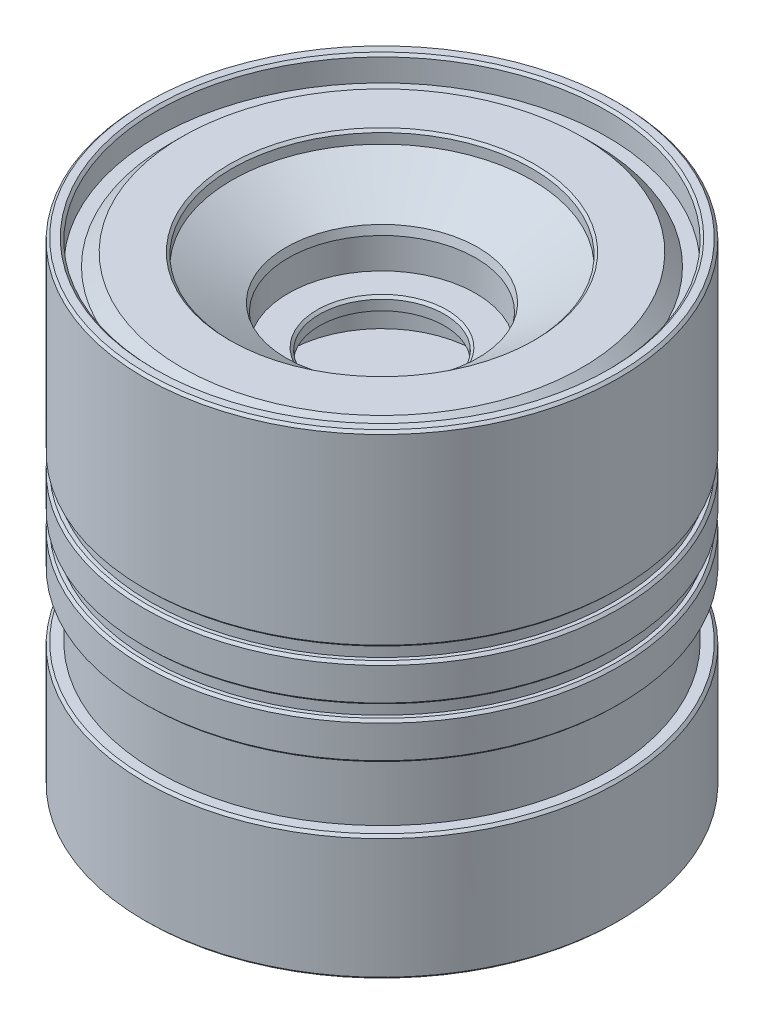
ISO-10303-21;
HEADER;
FILE_DESCRIPTION(('STEP AP214'),'2;1');
FILE_NAME('part.step','',(''),(''),'','','');
FILE_SCHEMA(('AUTOMOTIVE_DESIGN { 1 0 10303 214 1 1 1 1 }'));
ENDSEC;
DATA;
#1=APPLICATION_CONTEXT('core data for automotive mechanical design processes');
#2=APPLICATION_PROTOCOL_DEFINITION('international standard','automotive_design',2000,#1);
#3=PRODUCT_CONTEXT('',#1,'mechanical');
#4=PRODUCT('Part','Part','',(#3));
#5=PRODUCT_RELATED_PRODUCT_CATEGORY('part','',(#4));
#6=PRODUCT_DEFINITION_FORMATION('','',#4);
#7=PRODUCT_DEFINITION_CONTEXT('part definition',#1,'design');
#8=PRODUCT_DEFINITION('design','',#6,#7);
#9=PRODUCT_DEFINITION_SHAPE('','',#8);
#10=(LENGTH_UNIT() NAMED_UNIT(*) SI_UNIT(.MILLI.,.METRE.));
#11=(NAMED_UNIT(*) PLANE_ANGLE_UNIT() SI_UNIT($,.RADIAN.));
#12=(NAMED_UNIT(*) SI_UNIT($,.STERADIAN.) SOLID_ANGLE_UNIT());
#13=UNCERTAINTY_MEASURE_WITH_UNIT(LENGTH_MEASURE(1.E-05),#10,'distance_accuracy_value','');
#14=(GEOMETRIC_REPRESENTATION_CONTEXT(3) GLOBAL_UNCERTAINTY_ASSIGNED_CONTEXT((#13)) GLOBAL_UNIT_ASSIGNED_CONTEXT((#10,
#11,#12)) REPRESENTATION_CONTEXT('',''));
#15=CARTESIAN_POINT('',(0.,0.,0.));
#16=DIRECTION('',(0.,0.,1.));
#17=DIRECTION('',(1.,0.,0.));
#18=AXIS2_PLACEMENT_3D('',#15,#16,#17);
#19=CARTESIAN_POINT('',(0.,0.,0.));
#20=DIRECTION('',(0.,-1.,0.));
#21=DIRECTION('',(0.,0.,-1.));
#22=AXIS2_PLACEMENT_3D('',#19,#20,#21);
#23=PLANE('',#22);
#24=CARTESIAN_POINT('',(0.,0.,0.));
#25=DIRECTION('',(0.,-1.,0.));
#26=DIRECTION('',(0.,0.,-1.));
#27=AXIS2_PLACEMENT_3D('',#24,#25,#26);
#28=CIRCLE('',#27,18.8);
#29=CARTESIAN_POINT('',(0.,0.,-18.8));
#30=VERTEX_POINT('',#29);
#31=EDGE_CURVE('E92',#30,#30,#28,.T.);
#32=ORIENTED_EDGE('',*,*,#31,.T.);
#33=EDGE_LOOP('',(#32));
#34=FACE_BOUND('',#33,.T.);
#35=ADVANCED_FACE('F33',(#34),#23,.T.);
#36=CARTESIAN_POINT('',(0.,26.4019237886467,0.));
#37=DIRECTION('',(0.,1.,0.));
#38=DIRECTION('',(0.,0.,1.));
#39=AXIS2_PLACEMENT_3D('',#36,#37,#38);
#40=CYLINDRICAL_SURFACE('',#39,19.);
#41=CARTESIAN_POINT('',(0.,9.80000000000001,0.));
#42=DIRECTION('',(0.,1.,0.));
#43=DIRECTION('',(0.,0.,1.));
#44=AXIS2_PLACEMENT_3D('',#41,#42,#43);
#45=CIRCLE('',#44,19.);
#46=CARTESIAN_POINT('',(0.,9.8,19.));
#47=VERTEX_POINT('',#46);
#48=EDGE_CURVE('E95',#47,#47,#45,.F.);
#49=ORIENTED_EDGE('',*,*,#48,.T.);
#50=EDGE_LOOP('',(#49));
#51=FACE_BOUND('',#50,.T.);
#52=CARTESIAN_POINT('',(0.,0.199999999999975,0.));
#53=DIRECTION('',(0.,-1.,0.));
#54=DIRECTION('',(0.,0.,-1.));
#55=AXIS2_PLACEMENT_3D('',#52,#53,#54);
#56=CIRCLE('',#55,19.);
#57=CARTESIAN_POINT('',(0.,0.199999999999977,-19.));
#58=VERTEX_POINT('',#57);
#59=EDGE_CURVE('E98',#58,#58,#56,.F.);
#60=ORIENTED_EDGE('',*,*,#59,.T.);
#61=EDGE_LOOP('',(#60));
#62=FACE_BOUND('',#61,.T.);
#63=ADVANCED_FACE('F173',(#51,#62),#40,.T.);
#64=CARTESIAN_POINT('',(0.,10.,19.));
#65=DIRECTION('',(0.,1.,0.));
#66=DIRECTION('',(0.,0.,1.));
#67=AXIS2_PLACEMENT_3D('',#64,#65,#66);
#68=PLANE('',#67);
#69=CARTESIAN_POINT('',(0.,10.,0.));
#70=DIRECTION('',(0.,1.,0.));
#71=DIRECTION('',(0.,0.,1.));
#72=AXIS2_PLACEMENT_3D('',#69,#70,#71);
#73=CIRCLE('',#72,18.8);
#74=CARTESIAN_POINT('',(0.,10.,18.8));
#75=VERTEX_POINT('',#74);
#76=EDGE_CURVE('E101',#75,#75,#73,.T.);
#77=ORIENTED_EDGE('',*,*,#76,.T.);
#78=EDGE_LOOP('',(#77));
#79=FACE_BOUND('',#78,.T.);
#80=CARTESIAN_POINT('',(0.,10.,0.));
#81=DIRECTION('',(0.,1.,0.));
#82=DIRECTION('',(0.,0.,1.));
#83=AXIS2_PLACEMENT_3D('',#80,#81,#82);
#84=CIRCLE('',#83,18.);
#85=CARTESIAN_POINT('',(0.,10.,18.));
#86=VERTEX_POINT('',#85);
#87=EDGE_CURVE('E113',#86,#86,#84,.T.);
#88=ORIENTED_EDGE('',*,*,#87,.F.);
#89=EDGE_LOOP('',(#88));
#90=FACE_BOUND('',#89,.T.);
#91=ADVANCED_FACE('F179',(#79,#90),#68,.T.);
#92=CARTESIAN_POINT('',(0.,26.4019237886467,0.));
#93=DIRECTION('',(0.,1.,0.));
#94=DIRECTION('',(0.,0.,1.));
#95=AXIS2_PLACEMENT_3D('',#92,#93,#94);
#96=CYLINDRICAL_SURFACE('',#95,18.);
#97=ORIENTED_EDGE('',*,*,#87,.T.);
#98=EDGE_LOOP('',(#97));
#99=FACE_BOUND('',#98,.T.);
#100=CARTESIAN_POINT('',(0.,15.,0.));
#101=DIRECTION('',(0.,1.,0.));
#102=DIRECTION('',(0.,0.,1.));
#103=AXIS2_PLACEMENT_3D('',#100,#101,#102);
#104=CIRCLE('',#103,18.);
#105=CARTESIAN_POINT('',(0.,15.,18.));
#106=VERTEX_POINT('',#105);
#107=EDGE_CURVE('E116',#106,#106,#104,.T.);
#108=ORIENTED_EDGE('',*,*,#107,.F.);
#109=EDGE_LOOP('',(#108));
#110=FACE_BOUND('',#109,.T.);
#111=ADVANCED_FACE('F314',(#99,#110),#96,.T.);
#112=CARTESIAN_POINT('',(0.,15.,18.));
#113=DIRECTION('',(0.,-1.,0.));
#114=DIRECTION('',(0.,0.,-1.));
#115=AXIS2_PLACEMENT_3D('',#112,#113,#114);
#116=PLANE('',#115);
#117=CARTESIAN_POINT('',(0.,15.,0.));
#118=DIRECTION('',(0.,-1.,0.));
#119=DIRECTION('',(0.,0.,-1.));
#120=AXIS2_PLACEMENT_3D('',#117,#118,#119);
#121=CIRCLE('',#120,18.8);
#122=CARTESIAN_POINT('',(0.,15.,-18.8));
#123=VERTEX_POINT('',#122);
#124=EDGE_CURVE('E80',#123,#123,#121,.T.);
#125=ORIENTED_EDGE('',*,*,#124,.T.);
#126=EDGE_LOOP('',(#125));
#127=FACE_BOUND('',#126,.T.);
#128=ORIENTED_EDGE('',*,*,#107,.T.);
#129=EDGE_LOOP('',(#128));
#130=FACE_BOUND('',#129,.T.);
#131=ADVANCED_FACE('F310',(#127,#130),#116,.T.);
#132=CARTESIAN_POINT('',(0.,26.4019237886467,0.));
#133=DIRECTION('',(0.,1.,0.));
#134=DIRECTION('',(0.,0.,1.));
#135=AXIS2_PLACEMENT_3D('',#132,#133,#134);
#136=CYLINDRICAL_SURFACE('',#135,19.);
#137=CARTESIAN_POINT('',(0.,17.8,0.));
#138=DIRECTION('',(0.,1.,0.));
#139=DIRECTION('',(0.,0.,1.));
#140=AXIS2_PLACEMENT_3D('',#137,#138,#139);
#141=CIRCLE('',#140,19.);
#142=CARTESIAN_POINT('',(0.,17.8,19.));
#143=VERTEX_POINT('',#142);
#144=EDGE_CURVE('E83',#143,#143,#141,.F.);
#145=ORIENTED_EDGE('',*,*,#144,.T.);
#146=EDGE_LOOP('',(#145));
#147=FACE_BOUND('',#146,.T.);
#148=CARTESIAN_POINT('',(0.,15.2,0.));
#149=DIRECTION('',(0.,-1.,0.));
#150=DIRECTION('',(0.,0.,-1.));
#151=AXIS2_PLACEMENT_3D('',#148,#149,#150);
#152=CIRCLE('',#151,19.);
#153=CARTESIAN_POINT('',(0.,15.2,-19.));
#154=VERTEX_POINT('',#153);
#155=EDGE_CURVE('E86',#154,#154,#152,.F.);
#156=ORIENTED_EDGE('',*,*,#155,.T.);
#157=EDGE_LOOP('',(#156));
#158=FACE_BOUND('',#157,.T.);
#159=ADVANCED_FACE('F306',(#147,#158),#136,.T.);
#160=CARTESIAN_POINT('',(0.,18.,19.));
#161=DIRECTION('',(0.,1.,0.));
#162=DIRECTION('',(0.,0.,1.));
#163=AXIS2_PLACEMENT_3D('',#160,#161,#162);
#164=PLANE('',#163);
#165=CARTESIAN_POINT('',(0.,18.,0.));
#166=DIRECTION('',(0.,1.,0.));
#167=DIRECTION('',(0.,0.,1.));
#168=AXIS2_PLACEMENT_3D('',#165,#166,#167);
#169=CIRCLE('',#168,18.8);
#170=CARTESIAN_POINT('',(0.,18.,18.8));
#171=VERTEX_POINT('',#170);
#172=EDGE_CURVE('E89',#171,#171,#169,.T.);
#173=ORIENTED_EDGE('',*,*,#172,.T.);
#174=EDGE_LOOP('',(#173));
#175=FACE_BOUND('',#174,.T.);
#176=CARTESIAN_POINT('',(0.,18.,0.));
#177=DIRECTION('',(0.,1.,0.));
#178=DIRECTION('',(0.,0.,1.));
#179=AXIS2_PLACEMENT_3D('',#176,#177,#178);
#180=CIRCLE('',#179,18.5);
#181=CARTESIAN_POINT('',(0.,18.,18.5));
#182=VERTEX_POINT('',#181);
#183=EDGE_CURVE('E119',#182,#182,#180,.T.);
#184=ORIENTED_EDGE('',*,*,#183,.F.);
#185=EDGE_LOOP('',(#184));
#186=FACE_BOUND('',#185,.T.);
#187=ADVANCED_FACE('F302',(#175,#186),#164,.T.);
#188=CARTESIAN_POINT('',(0.,26.4019237886467,0.));
#189=DIRECTION('',(0.,1.,0.));
#190=DIRECTION('',(0.,0.,1.));
#191=AXIS2_PLACEMENT_3D('',#188,#189,#190);
#192=CYLINDRICAL_SURFACE('',#191,18.5);
#193=ORIENTED_EDGE('',*,*,#183,.T.);
#194=EDGE_LOOP('',(#193));
#195=FACE_BOUND('',#194,.T.);
#196=CARTESIAN_POINT('',(0.,19.,0.));
#197=DIRECTION('',(0.,1.,0.));
#198=DIRECTION('',(0.,0.,1.));
#199=AXIS2_PLACEMENT_3D('',#196,#197,#198);
#200=CIRCLE('',#199,18.5);
#201=CARTESIAN_POINT('',(0.,19.,18.5));
#202=VERTEX_POINT('',#201);
#203=EDGE_CURVE('E122',#202,#202,#200,.T.);
#204=ORIENTED_EDGE('',*,*,#203,.F.);
#205=EDGE_LOOP('',(#204));
#206=FACE_BOUND('',#205,.T.);
#207=ADVANCED_FACE('F298',(#195,#206),#192,.T.);
#208=CARTESIAN_POINT('',(0.,19.,18.5));
#209=DIRECTION('',(0.,-1.,0.));
#210=DIRECTION('',(0.,0.,-1.));
#211=AXIS2_PLACEMENT_3D('',#208,#209,#210);
#212=PLANE('',#211);
#213=CARTESIAN_POINT('',(0.,19.,0.));
#214=DIRECTION('',(0.,-1.,0.));
#215=DIRECTION('',(0.,0.,-1.));
#216=AXIS2_PLACEMENT_3D('',#213,#214,#215);
#217=CIRCLE('',#216,18.8);
#218=CARTESIAN_POINT('',(0.,19.,-18.8));
#219=VERTEX_POINT('',#218);
#220=EDGE_CURVE('E68',#219,#219,#217,.T.);
#221=ORIENTED_EDGE('',*,*,#220,.T.);
#222=EDGE_LOOP('',(#221));
#223=FACE_BOUND('',#222,.T.);
#224=ORIENTED_EDGE('',*,*,#203,.T.);
#225=EDGE_LOOP('',(#224));
#226=FACE_BOUND('',#225,.T.);
#227=ADVANCED_FACE('F294',(#223,#226),#212,.T.);
#228=CARTESIAN_POINT('',(0.,26.4019237886467,0.));
#229=DIRECTION('',(0.,1.,0.));
#230=DIRECTION('',(0.,0.,1.));
#231=AXIS2_PLACEMENT_3D('',#228,#229,#230);
#232=CYLINDRICAL_SURFACE('',#231,19.);
#233=CARTESIAN_POINT('',(0.,21.8,0.));
#234=DIRECTION('',(0.,1.,0.));
#235=DIRECTION('',(0.,0.,1.));
#236=AXIS2_PLACEMENT_3D('',#233,#234,#235);
#237=CIRCLE('',#236,19.);
#238=CARTESIAN_POINT('',(0.,21.8,19.));
#239=VERTEX_POINT('',#238);
#240=EDGE_CURVE('E71',#239,#239,#237,.F.);
#241=ORIENTED_EDGE('',*,*,#240,.T.);
#242=EDGE_LOOP('',(#241));
#243=FACE_BOUND('',#242,.T.);
#244=CARTESIAN_POINT('',(0.,19.2,0.));
#245=DIRECTION('',(0.,-1.,0.));
#246=DIRECTION('',(0.,0.,-1.));
#247=AXIS2_PLACEMENT_3D('',#244,#245,#246);
#248=CIRCLE('',#247,19.);
#249=CARTESIAN_POINT('',(0.,19.2,-19.));
#250=VERTEX_POINT('',#249);
#251=EDGE_CURVE('E74',#250,#250,#248,.F.);
#252=ORIENTED_EDGE('',*,*,#251,.T.);
#253=EDGE_LOOP('',(#252));
#254=FACE_BOUND('',#253,.T.);
#255=ADVANCED_FACE('F290',(#243,#254),#232,.T.);
#256=CARTESIAN_POINT('',(0.,22.,19.));
#257=DIRECTION('',(0.,1.,0.));
#258=DIRECTION('',(0.,0.,1.));
#259=AXIS2_PLACEMENT_3D('',#256,#257,#258);
#260=PLANE('',#259);
#261=CARTESIAN_POINT('',(0.,22.,0.));
#262=DIRECTION('',(0.,1.,0.));
#263=DIRECTION('',(0.,0.,1.));
#264=AXIS2_PLACEMENT_3D('',#261,#262,#263);
#265=CIRCLE('',#264,18.8);
#266=CARTESIAN_POINT('',(0.,22.,18.8));
#267=VERTEX_POINT('',#266);
#268=EDGE_CURVE('E77',#267,#267,#265,.T.);
#269=ORIENTED_EDGE('',*,*,#268,.T.);
#270=EDGE_LOOP('',(#269));
#271=FACE_BOUND('',#270,.T.);
#272=CARTESIAN_POINT('',(0.,22.,0.));
#273=DIRECTION('',(0.,1.,0.));
#274=DIRECTION('',(0.,0.,1.));
#275=AXIS2_PLACEMENT_3D('',#272,#273,#274);
#276=CIRCLE('',#275,18.5);
#277=CARTESIAN_POINT('',(0.,22.,18.5));
#278=VERTEX_POINT('',#277);
#279=EDGE_CURVE('E125',#278,#278,#276,.T.);
#280=ORIENTED_EDGE('',*,*,#279,.F.);
#281=EDGE_LOOP('',(#280));
#282=FACE_BOUND('',#281,.T.);
#283=ADVANCED_FACE('F286',(#271,#282),#260,.T.);
#284=CARTESIAN_POINT('',(0.,26.4019237886467,0.));
#285=DIRECTION('',(0.,1.,0.));
#286=DIRECTION('',(0.,0.,1.));
#287=AXIS2_PLACEMENT_3D('',#284,#285,#286);
#288=CYLINDRICAL_SURFACE('',#287,18.5);
#289=ORIENTED_EDGE('',*,*,#279,.T.);
#290=EDGE_LOOP('',(#289));
#291=FACE_BOUND('',#290,.T.);
#292=CARTESIAN_POINT('',(0.,23.,0.));
#293=DIRECTION('',(0.,1.,0.));
#294=DIRECTION('',(0.,0.,1.));
#295=AXIS2_PLACEMENT_3D('',#292,#293,#294);
#296=CIRCLE('',#295,18.5);
#297=CARTESIAN_POINT('',(0.,23.,18.5));
#298=VERTEX_POINT('',#297);
#299=EDGE_CURVE('E128',#298,#298,#296,.T.);
#300=ORIENTED_EDGE('',*,*,#299,.F.);
#301=EDGE_LOOP('',(#300));
#302=FACE_BOUND('',#301,.T.);
#303=ADVANCED_FACE('F282',(#291,#302),#288,.T.);
#304=CARTESIAN_POINT('',(0.,23.,18.5));
#305=DIRECTION('',(0.,-1.,0.));
#306=DIRECTION('',(0.,0.,-1.));
#307=AXIS2_PLACEMENT_3D('',#304,#305,#306);
#308=PLANE('',#307);
#309=CARTESIAN_POINT('',(0.,23.,0.));
#310=DIRECTION('',(0.,-1.,0.));
#311=DIRECTION('',(0.,0.,-1.));
#312=AXIS2_PLACEMENT_3D('',#309,#310,#311);
#313=CIRCLE('',#312,18.8);
#314=CARTESIAN_POINT('',(0.,23.,18.8));
#315=VERTEX_POINT('',#314);
#316=EDGE_CURVE('E59',#315,#315,#313,.T.);
#317=ORIENTED_EDGE('',*,*,#316,.T.);
#318=EDGE_LOOP('',(#317));
#319=FACE_BOUND('',#318,.T.);
#320=ORIENTED_EDGE('',*,*,#299,.T.);
#321=EDGE_LOOP('',(#320));
#322=FACE_BOUND('',#321,.T.);
#323=ADVANCED_FACE('F278',(#319,#322),#308,.T.);
#324=CARTESIAN_POINT('',(0.,26.4019237886467,0.));
#325=DIRECTION('',(0.,1.,0.));
#326=DIRECTION('',(0.,0.,1.));
#327=AXIS2_PLACEMENT_3D('',#324,#325,#326);
#328=CYLINDRICAL_SURFACE('',#327,19.);
#329=CARTESIAN_POINT('',(0.,37.8,0.));
#330=DIRECTION('',(0.,1.,0.));
#331=DIRECTION('',(0.,0.,1.));
#332=AXIS2_PLACEMENT_3D('',#329,#330,#331);
#333=CIRCLE('',#332,19.);
#334=CARTESIAN_POINT('',(0.,37.8,19.));
#335=VERTEX_POINT('',#334);
#336=EDGE_CURVE('E62',#335,#335,#333,.F.);
#337=ORIENTED_EDGE('',*,*,#336,.T.);
#338=EDGE_LOOP('',(#337));
#339=FACE_BOUND('',#338,.T.);
#340=CARTESIAN_POINT('',(0.,23.2,0.));
#341=DIRECTION('',(0.,-1.,0.));
#342=DIRECTION('',(0.,0.,-1.));
#343=AXIS2_PLACEMENT_3D('',#340,#341,#342);
#344=CIRCLE('',#343,19.);
#345=CARTESIAN_POINT('',(0.,23.2,19.));
#346=VERTEX_POINT('',#345);
#347=EDGE_CURVE('E65',#346,#346,#344,.F.);
#348=ORIENTED_EDGE('',*,*,#347,.T.);
#349=EDGE_LOOP('',(#348));
#350=FACE_BOUND('',#349,.T.);
#351=ADVANCED_FACE('F274',(#339,#350),#328,.T.);
#352=CARTESIAN_POINT('',(0.,38.,19.));
#353=DIRECTION('',(0.,1.,0.));
#354=DIRECTION('',(0.,0.,1.));
#355=AXIS2_PLACEMENT_3D('',#352,#353,#354);
#356=PLANE('',#355);
#357=CARTESIAN_POINT('',(0.,38.,0.));
#358=DIRECTION('',(0.,1.,0.));
#359=DIRECTION('',(0.,0.,1.));
#360=AXIS2_PLACEMENT_3D('',#357,#358,#359);
#361=CIRCLE('',#360,18.2);
#362=CARTESIAN_POINT('',(0.,38.,18.2));
#363=VERTEX_POINT('',#362);
#364=EDGE_CURVE('E104',#363,#363,#361,.F.);
#365=ORIENTED_EDGE('',*,*,#364,.T.);
#366=EDGE_LOOP('',(#365));
#367=FACE_BOUND('',#366,.T.);
#368=CARTESIAN_POINT('',(0.,38.,0.));
#369=DIRECTION('',(0.,1.,0.));
#370=DIRECTION('',(0.,0.,1.));
#371=AXIS2_PLACEMENT_3D('',#368,#369,#370);
#372=CIRCLE('',#371,18.8);
#373=CARTESIAN_POINT('',(0.,38.,18.8));
#374=VERTEX_POINT('',#373);
#375=EDGE_CURVE('E107',#374,#374,#372,.T.);
#376=ORIENTED_EDGE('',*,*,#375,.T.);
#377=EDGE_LOOP('',(#376));
#378=FACE_BOUND('',#377,.T.);
#379=ADVANCED_FACE('F270',(#367,#378),#356,.T.);
#380=CARTESIAN_POINT('',(0.,26.4019237886467,0.));
#381=DIRECTION('',(0.,1.,0.));
#382=DIRECTION('',(0.,0.,1.));
#383=AXIS2_PLACEMENT_3D('',#380,#381,#382);
#384=CYLINDRICAL_SURFACE('',#383,18.);
#385=CARTESIAN_POINT('',(0.,37.8,0.));
#386=DIRECTION('',(0.,1.,0.));
#387=DIRECTION('',(0.,0.,1.));
#388=AXIS2_PLACEMENT_3D('',#385,#386,#387);
#389=CIRCLE('',#388,18.);
#390=CARTESIAN_POINT('',(0.,37.8,18.));
#391=VERTEX_POINT('',#390);
#392=EDGE_CURVE('E110',#391,#391,#389,.T.);
#393=ORIENTED_EDGE('',*,*,#392,.T.);
#394=EDGE_LOOP('',(#393));
#395=FACE_BOUND('',#394,.T.);
#396=CARTESIAN_POINT('',(0.,36.,0.));
#397=DIRECTION('',(0.,1.,0.));
#398=DIRECTION('',(0.,0.,1.));
#399=AXIS2_PLACEMENT_3D('',#396,#397,#398);
#400=CIRCLE('',#399,18.);
#401=CARTESIAN_POINT('',(0.,36.,18.));
#402=VERTEX_POINT('',#401);
#403=EDGE_CURVE('E131',#402,#402,#400,.T.);
#404=ORIENTED_EDGE('',*,*,#403,.F.);
#405=EDGE_LOOP('',(#404));
#406=FACE_BOUND('',#405,.T.);
#407=ADVANCED_FACE('F266',(#395,#406),#384,.F.);
#408=CARTESIAN_POINT('',(0.,36.,18.));
#409=DIRECTION('',(0.,1.,0.));
#410=DIRECTION('',(0.,0.,1.));
#411=AXIS2_PLACEMENT_3D('',#408,#409,#410);
#412=PLANE('',#411);
#413=ORIENTED_EDGE('',*,*,#403,.T.);
#414=EDGE_LOOP('',(#413));
#415=FACE_BOUND('',#414,.T.);
#416=CARTESIAN_POINT('',(0.,36.,0.));
#417=DIRECTION('',(0.,1.,0.));
#418=DIRECTION('',(0.,0.,1.));
#419=AXIS2_PLACEMENT_3D('',#416,#417,#418);
#420=CIRCLE('',#419,17.);
#421=CARTESIAN_POINT('',(0.,36.,17.));
#422=VERTEX_POINT('',#421);
#423=EDGE_CURVE('E134',#422,#422,#420,.T.);
#424=ORIENTED_EDGE('',*,*,#423,.F.);
#425=EDGE_LOOP('',(#424));
#426=FACE_BOUND('',#425,.T.);
#427=ADVANCED_FACE('F262',(#415,#426),#412,.T.);
#428=CARTESIAN_POINT('',(0.,37.,0.));
#429=DIRECTION('',(0.,-1.,0.));
#430=DIRECTION('',(0.,0.,-1.));
#431=AXIS2_PLACEMENT_3D('',#428,#429,#430);
#432=CONICAL_SURFACE('',#431,16.,0.785398163397442);
#433=ORIENTED_EDGE('',*,*,#423,.T.);
#434=EDGE_LOOP('',(#433));
#435=FACE_BOUND('',#434,.T.);
#436=CARTESIAN_POINT('',(0.,37.,0.));
#437=DIRECTION('',(0.,1.,0.));
#438=DIRECTION('',(0.,0.,1.));
#439=AXIS2_PLACEMENT_3D('',#436,#437,#438);
#440=CIRCLE('',#439,16.);
#441=CARTESIAN_POINT('',(0.,37.,16.));
#442=VERTEX_POINT('',#441);
#443=EDGE_CURVE('E137',#442,#442,#440,.T.);
#444=ORIENTED_EDGE('',*,*,#443,.F.);
#445=EDGE_LOOP('',(#444));
#446=FACE_BOUND('',#445,.T.);
#447=ADVANCED_FACE('F259',(#435,#446),#432,.T.);
#448=CARTESIAN_POINT('',(0.,37.,16.));
#449=DIRECTION('',(0.,1.,0.));
#450=DIRECTION('',(0.,0.,1.));
#451=AXIS2_PLACEMENT_3D('',#448,#449,#450);
#452=PLANE('',#451);
#453=CARTESIAN_POINT('',(0.,37.,0.));
#454=DIRECTION('',(0.,1.,0.));
#455=DIRECTION('',(0.,0.,1.));
#456=AXIS2_PLACEMENT_3D('',#453,#454,#455);
#457=CIRCLE('',#456,12.2);
#458=CARTESIAN_POINT('',(0.,37.,12.2));
#459=VERTEX_POINT('',#458);
#460=EDGE_CURVE('E10',#459,#459,#457,.F.);
#461=ORIENTED_EDGE('',*,*,#460,.T.);
#462=EDGE_LOOP('',(#461));
#463=FACE_BOUND('',#462,.T.);
#464=ORIENTED_EDGE('',*,*,#443,.T.);
#465=EDGE_LOOP('',(#464));
#466=FACE_BOUND('',#465,.T.);
#467=ADVANCED_FACE('F256',(#463,#466),#452,.T.);
#468=CARTESIAN_POINT('',(0.,26.4019237886467,0.));
#469=DIRECTION('',(0.,1.,0.));
#470=DIRECTION('',(0.,0.,1.));
#471=AXIS2_PLACEMENT_3D('',#468,#469,#470);
#472=CYLINDRICAL_SURFACE('',#471,12.);
#473=CARTESIAN_POINT('',(0.,36.8,0.));
#474=DIRECTION('',(0.,1.,0.));
#475=DIRECTION('',(0.,0.,1.));
#476=AXIS2_PLACEMENT_3D('',#473,#474,#475);
#477=CIRCLE('',#476,12.);
#478=CARTESIAN_POINT('',(0.,36.8,12.));
#479=VERTEX_POINT('',#478);
#480=EDGE_CURVE('E40',#479,#479,#477,.T.);
#481=ORIENTED_EDGE('',*,*,#480,.T.);
#482=EDGE_LOOP('',(#481));
#483=FACE_BOUND('',#482,.T.);
#484=CARTESIAN_POINT('',(0.,36.,0.));
#485=DIRECTION('',(0.,1.,0.));
#486=DIRECTION('',(0.,0.,1.));
#487=AXIS2_PLACEMENT_3D('',#484,#485,#486);
#488=CIRCLE('',#487,12.);
#489=CARTESIAN_POINT('',(0.,36.,12.));
#490=VERTEX_POINT('',#489);
#491=EDGE_CURVE('E140',#490,#490,#488,.T.);
#492=ORIENTED_EDGE('',*,*,#491,.F.);
#493=EDGE_LOOP('',(#492));
#494=FACE_BOUND('',#493,.T.);
#495=ADVANCED_FACE('F252',(#483,#494),#472,.F.);
#496=CARTESIAN_POINT('',(0.,33.4019237886467,0.));
#497=DIRECTION('',(0.,1.,0.));
#498=DIRECTION('',(0.,0.,1.));
#499=AXIS2_PLACEMENT_3D('',#496,#497,#498);
#500=CONICAL_SURFACE('',#499,7.5,1.0471975511966);
#501=CARTESIAN_POINT('',(0.,33.5019237886467,0.));
#502=DIRECTION('',(0.,-1.,0.));
#503=DIRECTION('',(0.,0.,-1.));
#504=AXIS2_PLACEMENT_3D('',#501,#502,#503);
#505=CIRCLE('',#504,7.67320508075688);
#506=CARTESIAN_POINT('',(0.,33.5019237886467,-7.67320508075687));
#507=VERTEX_POINT('',#506);
#508=EDGE_CURVE('E44',#507,#507,#505,.T.);
#509=ORIENTED_EDGE('',*,*,#508,.T.);
#510=EDGE_LOOP('',(#509));
#511=FACE_BOUND('',#510,.T.);
#512=ORIENTED_EDGE('',*,*,#491,.T.);
#513=EDGE_LOOP('',(#512));
#514=FACE_BOUND('',#513,.T.);
#515=ADVANCED_FACE('F237',(#511,#514),#500,.F.);
#516=CARTESIAN_POINT('',(0.,26.4019237886467,0.));
#517=DIRECTION('',(0.,1.,0.));
#518=DIRECTION('',(0.,0.,1.));
#519=AXIS2_PLACEMENT_3D('',#516,#517,#518);
#520=CYLINDRICAL_SURFACE('',#519,7.5);
#521=CARTESIAN_POINT('',(0.,32.855513627133,0.));
#522=DIRECTION('',(0.,1.,0.));
#523=DIRECTION('',(0.,0.,1.));
#524=AXIS2_PLACEMENT_3D('',#521,#522,#523);
#525=CIRCLE('',#524,7.5);
#526=CARTESIAN_POINT('',(0.,32.855513627133,7.5));
#527=VERTEX_POINT('',#526);
#528=EDGE_CURVE('E48',#527,#527,#525,.T.);
#529=ORIENTED_EDGE('',*,*,#528,.T.);
#530=EDGE_LOOP('',(#529));
#531=FACE_BOUND('',#530,.T.);
#532=CARTESIAN_POINT('',(0.,30.4019237886467,0.));
#533=DIRECTION('',(0.,1.,0.));
#534=DIRECTION('',(0.,0.,1.));
#535=AXIS2_PLACEMENT_3D('',#532,#533,#534);
#536=CIRCLE('',#535,7.5);
#537=CARTESIAN_POINT('',(0.,30.4019237886467,7.5));
#538=VERTEX_POINT('',#537);
#539=EDGE_CURVE('E143',#538,#538,#536,.T.);
#540=ORIENTED_EDGE('',*,*,#539,.F.);
#541=EDGE_LOOP('',(#540));
#542=FACE_BOUND('',#541,.T.);
#543=ADVANCED_FACE('F233',(#531,#542),#520,.F.);
#544=CARTESIAN_POINT('',(0.,30.4019237886467,7.5));
#545=DIRECTION('',(0.,1.,0.));
#546=DIRECTION('',(0.,0.,1.));
#547=AXIS2_PLACEMENT_3D('',#544,#545,#546);
#548=PLANE('',#547);
#549=CARTESIAN_POINT('',(0.,30.4019237886467,0.));
#550=DIRECTION('',(0.,1.,0.));
#551=DIRECTION('',(0.,0.,1.));
#552=AXIS2_PLACEMENT_3D('',#549,#550,#551);
#553=CIRCLE('',#552,5.19999999999999);
#554=CARTESIAN_POINT('',(0.,30.4019237886467,5.19999999999999));
#555=VERTEX_POINT('',#554);
#556=EDGE_CURVE('E53',#555,#555,#553,.F.);
#557=ORIENTED_EDGE('',*,*,#556,.T.);
#558=EDGE_LOOP('',(#557));
#559=FACE_BOUND('',#558,.T.);
#560=ORIENTED_EDGE('',*,*,#539,.T.);
#561=EDGE_LOOP('',(#560));
#562=FACE_BOUND('',#561,.T.);
#563=ADVANCED_FACE('F236',(#559,#562),#548,.T.);
#564=CARTESIAN_POINT('',(0.,26.4019237886467,0.));
#565=DIRECTION('',(0.,1.,0.));
#566=DIRECTION('',(0.,0.,1.));
#567=AXIS2_PLACEMENT_3D('',#564,#565,#566);
#568=CYLINDRICAL_SURFACE('',#567,5.);
#569=CARTESIAN_POINT('',(0.,30.2019237886467,0.));
#570=DIRECTION('',(0.,1.,0.));
#571=DIRECTION('',(0.,0.,1.));
#572=AXIS2_PLACEMENT_3D('',#569,#570,#571);
#573=CIRCLE('',#572,5.);
#574=CARTESIAN_POINT('',(0.,30.2019237886467,5.));
#575=VERTEX_POINT('',#574);
#576=EDGE_CURVE('E56',#575,#575,#573,.T.);
#577=ORIENTED_EDGE('',*,*,#576,.T.);
#578=EDGE_LOOP('',(#577));
#579=FACE_BOUND('',#578,.T.);
#580=CARTESIAN_POINT('',(0.,29.4019237886467,0.));
#581=DIRECTION('',(0.,1.,0.));
#582=DIRECTION('',(0.,0.,1.));
#583=AXIS2_PLACEMENT_3D('',#580,#581,#582);
#584=CIRCLE('',#583,5.);
#585=CARTESIAN_POINT('',(0.,29.4019237886467,5.));
#586=VERTEX_POINT('',#585);
#587=EDGE_CURVE('E146',#586,#586,#584,.T.);
#588=ORIENTED_EDGE('',*,*,#587,.F.);
#589=EDGE_LOOP('',(#588));
#590=FACE_BOUND('',#589,.T.);
#591=ADVANCED_FACE('F169',(#579,#590),#568,.F.);
#592=CARTESIAN_POINT('',(0.,29.4019237886467,5.));
#593=DIRECTION('',(0.,-1.,0.));
#594=DIRECTION('',(0.,0.,-1.));
#595=AXIS2_PLACEMENT_3D('',#592,#593,#594);
#596=PLANE('',#595);
#597=ORIENTED_EDGE('',*,*,#587,.T.);
#598=EDGE_LOOP('',(#597));
#599=FACE_BOUND('',#598,.T.);
#600=CARTESIAN_POINT('',(0.,29.4019237886467,0.));
#601=DIRECTION('',(0.,1.,0.));
#602=DIRECTION('',(0.,0.,1.));
#603=AXIS2_PLACEMENT_3D('',#600,#601,#602);
#604=CIRCLE('',#603,7.5);
#605=CARTESIAN_POINT('',(0.,29.4019237886467,7.5));
#606=VERTEX_POINT('',#605);
#607=EDGE_CURVE('E149',#606,#606,#604,.T.);
#608=ORIENTED_EDGE('',*,*,#607,.F.);
#609=EDGE_LOOP('',(#608));
#610=FACE_BOUND('',#609,.T.);
#611=ADVANCED_FACE('F160',(#599,#610),#596,.T.);
#612=CARTESIAN_POINT('',(0.,26.4019237886467,0.));
#613=DIRECTION('',(0.,1.,0.));
#614=DIRECTION('',(0.,0.,1.));
#615=AXIS2_PLACEMENT_3D('',#612,#613,#614);
#616=CYLINDRICAL_SURFACE('',#615,7.5);
#617=ORIENTED_EDGE('',*,*,#607,.T.);
#618=EDGE_LOOP('',(#617));
#619=FACE_BOUND('',#618,.T.);
#620=CARTESIAN_POINT('',(0.,26.4019237886467,0.));
#621=DIRECTION('',(0.,1.,0.));
#622=DIRECTION('',(0.,0.,1.));
#623=AXIS2_PLACEMENT_3D('',#620,#621,#622);
#624=CIRCLE('',#623,7.5);
#625=CARTESIAN_POINT('',(0.,26.4019237886467,7.5));
#626=VERTEX_POINT('',#625);
#627=EDGE_CURVE('E152',#626,#626,#624,.T.);
#628=ORIENTED_EDGE('',*,*,#627,.F.);
#629=EDGE_LOOP('',(#628));
#630=FACE_BOUND('',#629,.T.);
#631=ADVANCED_FACE('F158',(#619,#630),#616,.F.);
#632=CARTESIAN_POINT('',(0.,26.4019237886467,7.5));
#633=DIRECTION('',(0.,1.,0.));
#634=DIRECTION('',(0.,0.,1.));
#635=AXIS2_PLACEMENT_3D('',#632,#633,#634);
#636=PLANE('',#635);
#637=ORIENTED_EDGE('',*,*,#627,.T.);
#638=EDGE_LOOP('',(#637));
#639=FACE_BOUND('',#638,.T.);
#640=ADVANCED_FACE('F156',(#639),#636,.T.);
#641=CARTESIAN_POINT('',(0.,37.8,0.));
#642=DIRECTION('',(0.,1.,0.));
#643=DIRECTION('',(0.,0.,1.));
#644=AXIS2_PLACEMENT_3D('',#641,#642,#643);
#645=CONICAL_SURFACE('',#644,18.,0.785398163397448);
#646=ORIENTED_EDGE('',*,*,#364,.F.);
#647=EDGE_LOOP('',(#646));
#648=FACE_BOUND('',#647,.T.);
#649=ORIENTED_EDGE('',*,*,#392,.F.);
#650=EDGE_LOOP('',(#649));
#651=FACE_BOUND('',#650,.T.);
#652=ADVANCED_FACE('F167',(#648,#651),#645,.F.);
#653=CARTESIAN_POINT('',(0.,10.,0.));
#654=DIRECTION('',(0.,-1.,0.));
#655=DIRECTION('',(0.,0.,-1.));
#656=AXIS2_PLACEMENT_3D('',#653,#654,#655);
#657=CONICAL_SURFACE('',#656,18.8,0.785398163397422);
#658=ORIENTED_EDGE('',*,*,#48,.F.);
#659=EDGE_LOOP('',(#658));
#660=FACE_BOUND('',#659,.T.);
#661=ORIENTED_EDGE('',*,*,#76,.F.);
#662=EDGE_LOOP('',(#661));
#663=FACE_BOUND('',#662,.T.);
#664=ADVANCED_FACE('F186',(#660,#663),#657,.T.);
#665=CARTESIAN_POINT('',(0.,0.199999999999975,0.));
#666=DIRECTION('',(0.,1.,0.));
#667=DIRECTION('',(0.,0.,1.));
#668=AXIS2_PLACEMENT_3D('',#665,#666,#667);
#669=CONICAL_SURFACE('',#668,19.,0.785398163397448);
#670=ORIENTED_EDGE('',*,*,#31,.F.);
#671=EDGE_LOOP('',(#670));
#672=FACE_BOUND('',#671,.T.);
#673=ORIENTED_EDGE('',*,*,#59,.F.);
#674=EDGE_LOOP('',(#673));
#675=FACE_BOUND('',#674,.T.);
#676=ADVANCED_FACE('F190',(#672,#675),#669,.T.);
#677=CARTESIAN_POINT('',(0.,18.,0.));
#678=DIRECTION('',(0.,-1.,0.));
#679=DIRECTION('',(0.,0.,-1.));
#680=AXIS2_PLACEMENT_3D('',#677,#678,#679);
#681=CONICAL_SURFACE('',#680,18.8,0.785398163397466);
#682=ORIENTED_EDGE('',*,*,#144,.F.);
#683=EDGE_LOOP('',(#682));
#684=FACE_BOUND('',#683,.T.);
#685=ORIENTED_EDGE('',*,*,#172,.F.);
#686=EDGE_LOOP('',(#685));
#687=FACE_BOUND('',#686,.T.);
#688=ADVANCED_FACE('F194',(#684,#687),#681,.T.);
#689=CARTESIAN_POINT('',(0.,15.2,0.));
#690=DIRECTION('',(0.,1.,0.));
#691=DIRECTION('',(0.,0.,1.));
#692=AXIS2_PLACEMENT_3D('',#689,#690,#691);
#693=CONICAL_SURFACE('',#692,19.,0.78539816339744);
#694=ORIENTED_EDGE('',*,*,#124,.F.);
#695=EDGE_LOOP('',(#694));
#696=FACE_BOUND('',#695,.T.);
#697=ORIENTED_EDGE('',*,*,#155,.F.);
#698=EDGE_LOOP('',(#697));
#699=FACE_BOUND('',#698,.T.);
#700=ADVANCED_FACE('F198',(#696,#699),#693,.T.);
#701=CARTESIAN_POINT('',(0.,22.,0.));
#702=DIRECTION('',(0.,-1.,0.));
#703=DIRECTION('',(0.,0.,-1.));
#704=AXIS2_PLACEMENT_3D('',#701,#702,#703);
#705=CONICAL_SURFACE('',#704,18.8,0.785398163397474);
#706=ORIENTED_EDGE('',*,*,#240,.F.);
#707=EDGE_LOOP('',(#706));
#708=FACE_BOUND('',#707,.T.);
#709=ORIENTED_EDGE('',*,*,#268,.F.);
#710=EDGE_LOOP('',(#709));
#711=FACE_BOUND('',#710,.T.);
#712=ADVANCED_FACE('F202',(#708,#711),#705,.T.);
#713=CARTESIAN_POINT('',(0.,19.2,0.));
#714=DIRECTION('',(0.,1.,0.));
#715=DIRECTION('',(0.,0.,1.));
#716=AXIS2_PLACEMENT_3D('',#713,#714,#715);
#717=CONICAL_SURFACE('',#716,19.,0.785398163397448);
#718=ORIENTED_EDGE('',*,*,#220,.F.);
#719=EDGE_LOOP('',(#718));
#720=FACE_BOUND('',#719,.T.);
#721=ORIENTED_EDGE('',*,*,#251,.F.);
#722=EDGE_LOOP('',(#721));
#723=FACE_BOUND('',#722,.T.);
#724=ADVANCED_FACE('F206',(#720,#723),#717,.T.);
#725=CARTESIAN_POINT('',(0.,38.,0.));
#726=DIRECTION('',(0.,-1.,0.));
#727=DIRECTION('',(0.,0.,-1.));
#728=AXIS2_PLACEMENT_3D('',#725,#726,#727);
#729=CONICAL_SURFACE('',#728,18.8,0.785398163397422);
#730=ORIENTED_EDGE('',*,*,#336,.F.);
#731=EDGE_LOOP('',(#730));
#732=FACE_BOUND('',#731,.T.);
#733=ORIENTED_EDGE('',*,*,#375,.F.);
#734=EDGE_LOOP('',(#733));
#735=FACE_BOUND('',#734,.T.);
#736=ADVANCED_FACE('F210',(#732,#735),#729,.T.);
#737=CARTESIAN_POINT('',(0.,23.2,0.));
#738=DIRECTION('',(0.,1.,0.));
#739=DIRECTION('',(0.,0.,1.));
#740=AXIS2_PLACEMENT_3D('',#737,#738,#739);
#741=CONICAL_SURFACE('',#740,19.,0.78539816339744);
#742=CARTESIAN_POINT('',(0.,23.,18.8));
#743=CARTESIAN_POINT('',(0.,23.0020833333333,18.8020833333333));
#744=CARTESIAN_POINT('',(0.,23.0041666666667,18.8041666666667));
#745=CARTESIAN_POINT('',(0.,23.0083333333333,18.8083333333334));
#746=CARTESIAN_POINT('',(0.,23.0104166666667,18.8104166666667));
#747=CARTESIAN_POINT('',(0.,23.0145833333333,18.8145833333333));
#748=CARTESIAN_POINT('',(0.,23.0166666666667,18.8166666666667));
#749=CARTESIAN_POINT('',(0.,23.0208333333333,18.8208333333334));
#750=CARTESIAN_POINT('',(0.,23.0229166666667,18.8229166666667));
#751=CARTESIAN_POINT('',(0.,23.0270833333333,18.8270833333333));
#752=CARTESIAN_POINT('',(0.,23.0291666666667,18.8291666666667));
#753=CARTESIAN_POINT('',(0.,23.0333333333333,18.8333333333333));
#754=CARTESIAN_POINT('',(0.,23.0354166666667,18.8354166666667));
#755=CARTESIAN_POINT('',(0.,23.0395833333333,18.8395833333333));
#756=CARTESIAN_POINT('',(0.,23.0416666666667,18.8416666666667));
#757=CARTESIAN_POINT('',(0.,23.0458333333333,18.8458333333333));
#758=CARTESIAN_POINT('',(0.,23.0479166666667,18.8479166666667));
#759=CARTESIAN_POINT('',(0.,23.0520833333333,18.8520833333333));
#760=CARTESIAN_POINT('',(0.,23.0541666666667,18.8541666666667));
#761=CARTESIAN_POINT('',(0.,23.0583333333333,18.8583333333333));
#762=CARTESIAN_POINT('',(0.,23.0604166666667,18.8604166666667));
#763=CARTESIAN_POINT('',(0.,23.0645833333333,18.8645833333333));
#764=CARTESIAN_POINT('',(0.,23.0666666666667,18.8666666666667));
#765=CARTESIAN_POINT('',(0.,23.0708333333333,18.8708333333333));
#766=CARTESIAN_POINT('',(0.,23.0729166666667,18.8729166666667));
#767=CARTESIAN_POINT('',(0.,23.0770833333333,18.8770833333333));
#768=CARTESIAN_POINT('',(0.,23.0791666666667,18.8791666666667));
#769=CARTESIAN_POINT('',(0.,23.0833333333333,18.8833333333333));
#770=CARTESIAN_POINT('',(0.,23.0854166666667,18.8854166666667));
#771=CARTESIAN_POINT('',(0.,23.0895833333333,18.8895833333333));
#772=CARTESIAN_POINT('',(0.,23.0916666666667,18.8916666666667));
#773=CARTESIAN_POINT('',(0.,23.0958333333333,18.8958333333333));
#774=CARTESIAN_POINT('',(0.,23.0979166666667,18.8979166666667));
#775=CARTESIAN_POINT('',(0.,23.1020833333333,18.9020833333333));
#776=CARTESIAN_POINT('',(0.,23.1041666666667,18.9041666666667));
#777=CARTESIAN_POINT('',(0.,23.1083333333333,18.9083333333333));
#778=CARTESIAN_POINT('',(0.,23.1104166666667,18.9104166666667));
#779=CARTESIAN_POINT('',(0.,23.1145833333333,18.9145833333333));
#780=CARTESIAN_POINT('',(0.,23.1166666666667,18.9166666666667));
#781=CARTESIAN_POINT('',(0.,23.1208333333333,18.9208333333333));
#782=CARTESIAN_POINT('',(0.,23.1229166666667,18.9229166666667));
#783=CARTESIAN_POINT('',(0.,23.1270833333333,18.9270833333333));
#784=CARTESIAN_POINT('',(0.,23.1291666666667,18.9291666666667));
#785=CARTESIAN_POINT('',(0.,23.1333333333333,18.9333333333333));
#786=CARTESIAN_POINT('',(0.,23.1354166666667,18.9354166666667));
#787=CARTESIAN_POINT('',(0.,23.1395833333333,18.9395833333333));
#788=CARTESIAN_POINT('',(0.,23.1416666666667,18.9416666666667));
#789=CARTESIAN_POINT('',(0.,23.1458333333333,18.9458333333333));
#790=CARTESIAN_POINT('',(0.,23.1479166666667,18.9479166666667));
#791=CARTESIAN_POINT('',(0.,23.1520833333333,18.9520833333333));
#792=CARTESIAN_POINT('',(0.,23.1541666666667,18.9541666666667));
#793=CARTESIAN_POINT('',(0.,23.1583333333333,18.9583333333333));
#794=CARTESIAN_POINT('',(0.,23.1604166666667,18.9604166666667));
#795=CARTESIAN_POINT('',(0.,23.1645833333333,18.9645833333333));
#796=CARTESIAN_POINT('',(0.,23.1666666666667,18.9666666666667));
#797=CARTESIAN_POINT('',(0.,23.1708333333333,18.9708333333333));
#798=CARTESIAN_POINT('',(0.,23.1729166666667,18.9729166666667));
#799=CARTESIAN_POINT('',(0.,23.1770833333333,18.9770833333333));
#800=CARTESIAN_POINT('',(0.,23.1791666666667,18.9791666666667));
#801=CARTESIAN_POINT('',(0.,23.1833333333333,18.9833333333333));
#802=CARTESIAN_POINT('',(0.,23.1854166666667,18.9854166666667));
#803=CARTESIAN_POINT('',(0.,23.1895833333333,18.9895833333333));
#804=CARTESIAN_POINT('',(0.,23.1916666666667,18.9916666666667));
#805=CARTESIAN_POINT('',(0.,23.1958333333333,18.9958333333333));
#806=CARTESIAN_POINT('',(0.,23.1979166666667,18.9979166666667));
#807=CARTESIAN_POINT('',(0.,23.2,19.));
#808=B_SPLINE_CURVE_WITH_KNOTS('',3,(#742,#743,#744,#745,#746,#747,#748,#749,#750,#751,#752,
#753,#754,#755,#756,#757,#758,#759,#760,#761,#762,#763,#764,#765,#766,#767,#768,#769,#770,#771,
#772,#773,#774,#775,#776,#777,#778,#779,#780,#781,#782,#783,#784,#785,#786,#787,#788,#789,#790,
#791,#792,#793,#794,#795,#796,#797,#798,#799,#800,#801,#802,#803,#804,#805,#806,#807),
.UNSPECIFIED.,.F.,.F.,(4,2,2,2,2,2,2,2,2,2,2,2,2,2,2,2,2,2,2,2,2,2,2,2,2,2,2,2,2,2,2,2,4),(0.,
0.00883883476483332,0.0176776695296642,0.0265165042944951,0.0353553390593259,0.0441941738241568,
0.0530330085889877,0.0618718433538185,0.0707106781186494,0.0795495128834803,0.0883883476483111,
0.0972271824131445,0.106066017177975,0.114904851942806,0.123743686707637,0.132582521472468,
0.141421356237301,0.150260191002132,0.159099025766963,0.167937860531794,0.176776695296625,
0.185615530061456,0.194454364826289,0.20329319959112,0.212132034355951,0.220970869120782,
0.229809703885613,0.238648538650443,0.247487373415274,0.256326208180105,0.265165042944936,
0.274003877709767,0.282842712474598),.UNSPECIFIED.);
#809=EDGE_CURVE('BSEAM214',#315,#346,#808,.T.);
#810=ORIENTED_EDGE('',*,*,#316,.F.);
#811=ORIENTED_EDGE('',*,*,#347,.F.);
#812=ORIENTED_EDGE('',*,*,#809,.T.);
#813=ORIENTED_EDGE('',*,*,#809,.F.);
#814=EDGE_LOOP('',(#810,#812,#811,#813));
#815=FACE_BOUND('',#814,.T.);
#816=ADVANCED_FACE('F214',(#815),#741,.T.);
#817=CARTESIAN_POINT('',(0.,30.2019237886467,0.));
#818=DIRECTION('',(0.,1.,0.));
#819=DIRECTION('',(0.,0.,1.));
#820=AXIS2_PLACEMENT_3D('',#817,#818,#819);
#821=CONICAL_SURFACE('',#820,5.,0.785398163397453);
#822=ORIENTED_EDGE('',*,*,#556,.F.);
#823=EDGE_LOOP('',(#822));
#824=FACE_BOUND('',#823,.T.);
#825=ORIENTED_EDGE('',*,*,#576,.F.);
#826=EDGE_LOOP('',(#825));
#827=FACE_BOUND('',#826,.T.);
#828=ADVANCED_FACE('F218',(#824,#827),#821,.F.);
#829=CARTESIAN_POINT('',(0.,32.855513627133,0.));
#830=DIRECTION('',(0.,1.,0.));
#831=DIRECTION('',(0.,0.,1.));
#832=AXIS2_PLACEMENT_3D('',#829,#830,#831);
#833=CONICAL_SURFACE('',#832,7.5,0.26179938779917);
#834=ORIENTED_EDGE('',*,*,#508,.F.);
#835=EDGE_LOOP('',(#834));
#836=FACE_BOUND('',#835,.T.);
#837=ORIENTED_EDGE('',*,*,#528,.F.);
#838=EDGE_LOOP('',(#837));
#839=FACE_BOUND('',#838,.T.);
#840=ADVANCED_FACE('F221',(#836,#839),#833,.F.);
#841=CARTESIAN_POINT('',(0.,36.8,0.));
#842=DIRECTION('',(0.,1.,0.));
#843=DIRECTION('',(0.,0.,1.));
#844=AXIS2_PLACEMENT_3D('',#841,#842,#843);
#845=CONICAL_SURFACE('',#844,12.,0.78539816339744);
#846=CARTESIAN_POINT('',(0.,37.,12.2));
#847=CARTESIAN_POINT('',(0.,36.9979166666667,12.1979166666666));
#848=CARTESIAN_POINT('',(0.,36.9958333333333,12.1958333333333));
#849=CARTESIAN_POINT('',(0.,36.9916666666667,12.1916666666666));
#850=CARTESIAN_POINT('',(0.,36.9895833333333,12.1895833333333));
#851=CARTESIAN_POINT('',(0.,36.9854166666667,12.1854166666666));
#852=CARTESIAN_POINT('',(0.,36.9833333333333,12.1833333333333));
#853=CARTESIAN_POINT('',(0.,36.9791666666667,12.1791666666666));
#854=CARTESIAN_POINT('',(0.,36.9770833333333,12.1770833333333));
#855=CARTESIAN_POINT('',(0.,36.9729166666667,12.1729166666666));
#856=CARTESIAN_POINT('',(0.,36.9708333333333,12.1708333333333));
#857=CARTESIAN_POINT('',(0.,36.9666666666667,12.1666666666667));
#858=CARTESIAN_POINT('',(0.,36.9645833333333,12.1645833333333));
#859=CARTESIAN_POINT('',(0.,36.9604166666667,12.1604166666667));
#860=CARTESIAN_POINT('',(0.,36.9583333333333,12.1583333333333));
#861=CARTESIAN_POINT('',(0.,36.9541666666667,12.1541666666667));
#862=CARTESIAN_POINT('',(0.,36.9520833333333,12.1520833333333));
#863=CARTESIAN_POINT('',(0.,36.9479166666667,12.1479166666667));
#864=CARTESIAN_POINT('',(0.,36.9458333333333,12.1458333333333));
#865=CARTESIAN_POINT('',(0.,36.9416666666667,12.1416666666667));
#866=CARTESIAN_POINT('',(0.,36.9395833333333,12.1395833333333));
#867=CARTESIAN_POINT('',(0.,36.9354166666667,12.1354166666667));
#868=CARTESIAN_POINT('',(0.,36.9333333333333,12.1333333333333));
#869=CARTESIAN_POINT('',(0.,36.9291666666667,12.1291666666667));
#870=CARTESIAN_POINT('',(0.,36.9270833333333,12.1270833333333));
#871=CARTESIAN_POINT('',(0.,36.9229166666667,12.1229166666667));
#872=CARTESIAN_POINT('',(0.,36.9208333333333,12.1208333333333));
#873=CARTESIAN_POINT('',(0.,36.9166666666667,12.1166666666667));
#874=CARTESIAN_POINT('',(0.,36.9145833333333,12.1145833333333));
#875=CARTESIAN_POINT('',(0.,36.9104166666667,12.1104166666667));
#876=CARTESIAN_POINT('',(0.,36.9083333333333,12.1083333333333));
#877=CARTESIAN_POINT('',(0.,36.9041666666667,12.1041666666667));
#878=CARTESIAN_POINT('',(0.,36.9020833333333,12.1020833333333));
#879=CARTESIAN_POINT('',(0.,36.8979166666667,12.0979166666667));
#880=CARTESIAN_POINT('',(0.,36.8958333333333,12.0958333333333));
#881=CARTESIAN_POINT('',(0.,36.8916666666667,12.0916666666667));
#882=CARTESIAN_POINT('',(0.,36.8895833333333,12.0895833333333));
#883=CARTESIAN_POINT('',(0.,36.8854166666667,12.0854166666667));
#884=CARTESIAN_POINT('',(0.,36.8833333333333,12.0833333333333));
#885=CARTESIAN_POINT('',(0.,36.8791666666667,12.0791666666667));
#886=CARTESIAN_POINT('',(0.,36.8770833333333,12.0770833333333));
#887=CARTESIAN_POINT('',(0.,36.8729166666667,12.0729166666667));
#888=CARTESIAN_POINT('',(0.,36.8708333333333,12.0708333333333));
#889=CARTESIAN_POINT('',(0.,36.8666666666667,12.0666666666667));
#890=CARTESIAN_POINT('',(0.,36.8645833333333,12.0645833333333));
#891=CARTESIAN_POINT('',(0.,36.8604166666667,12.0604166666667));
#892=CARTESIAN_POINT('',(0.,36.8583333333333,12.0583333333333));
#893=CARTESIAN_POINT('',(0.,36.8541666666667,12.0541666666667));
#894=CARTESIAN_POINT('',(0.,36.8520833333333,12.0520833333333));
#895=CARTESIAN_POINT('',(0.,36.8479166666667,12.0479166666667));
#896=CARTESIAN_POINT('',(0.,36.8458333333333,12.0458333333333));
#897=CARTESIAN_POINT('',(0.,36.8416666666667,12.0416666666667));
#898=CARTESIAN_POINT('',(0.,36.8395833333333,12.0395833333333));
#899=CARTESIAN_POINT('',(0.,36.8354166666667,12.0354166666667));
#900=CARTESIAN_POINT('',(0.,36.8333333333333,12.0333333333333));
#901=CARTESIAN_POINT('',(0.,36.8291666666667,12.0291666666667));
#902=CARTESIAN_POINT('',(0.,36.8270833333333,12.0270833333333));
#903=CARTESIAN_POINT('',(0.,36.8229166666667,12.0229166666667));
#904=CARTESIAN_POINT('',(0.,36.8208333333333,12.0208333333333));
#905=CARTESIAN_POINT('',(0.,36.8166666666667,12.0166666666667));
#906=CARTESIAN_POINT('',(0.,36.8145833333333,12.0145833333333));
#907=CARTESIAN_POINT('',(0.,36.8104166666667,12.0104166666667));
#908=CARTESIAN_POINT('',(0.,36.8083333333333,12.0083333333333));
#909=CARTESIAN_POINT('',(0.,36.8041666666667,12.0041666666667));
#910=CARTESIAN_POINT('',(0.,36.8020833333333,12.0020833333333));
#911=CARTESIAN_POINT('',(0.,36.8,12.));
#912=B_SPLINE_CURVE_WITH_KNOTS('',3,(#846,#847,#848,#849,#850,#851,#852,#853,#854,#855,#856,
#857,#858,#859,#860,#861,#862,#863,#864,#865,#866,#867,#868,#869,#870,#871,#872,#873,#874,#875,
#876,#877,#878,#879,#880,#881,#882,#883,#884,#885,#886,#887,#888,#889,#890,#891,#892,#893,#894,
#895,#896,#897,#898,#899,#900,#901,#902,#903,#904,#905,#906,#907,#908,#909,#910,#911),
.UNSPECIFIED.,.F.,.F.,(4,2,2,2,2,2,2,2,2,2,2,2,2,2,2,2,2,2,2,2,2,2,2,2,2,2,2,2,2,2,2,2,4),(0.,
0.00883883476483087,0.0176776695296617,0.0265165042944926,0.0353553390593235,0.0441941738241543,
0.0530330085889852,0.0618718433538161,0.0707106781186457,0.0795495128834766,0.0883883476483075,
0.0972271824131383,0.106066017177974,0.1149048519428,0.123743686707631,0.132582521472462,
0.141421356237293,0.150260191002124,0.159099025766954,0.167937860531785,0.176776695296616,
0.185615530061447,0.194454364826278,0.203293199591109,0.212132034355945,0.220970869120774,
0.229809703885605,0.238648538650436,0.247487373415267,0.256326208180098,0.265165042944929,
0.27400387770976,0.282842712474586),.UNSPECIFIED.);
#913=EDGE_CURVE('BSEAM35',#459,#479,#912,.T.);
#914=ORIENTED_EDGE('',*,*,#460,.F.);
#915=ORIENTED_EDGE('',*,*,#480,.F.);
#916=ORIENTED_EDGE('',*,*,#913,.T.);
#917=ORIENTED_EDGE('',*,*,#913,.F.);
#918=EDGE_LOOP('',(#914,#916,#915,#917));
#919=FACE_BOUND('',#918,.T.);
#920=ADVANCED_FACE('F35',(#919),#845,.F.);
#921=CLOSED_SHELL('',(#35,#63,#91,#111,#131,#159,#187,#207,#227,#255,#283,#303,#323,#351,#379,
#407,#427,#447,#467,#495,#515,#543,#563,#591,#611,#631,#640,#652,#664,#676,#688,#700,#712,#724,
#736,#816,#828,#840,#920));
#922=MANIFOLD_SOLID_BREP('B2',#921);
#923=ADVANCED_BREP_SHAPE_REPRESENTATION('',(#18,#922),#14);
#924=SHAPE_DEFINITION_REPRESENTATION(#9,#923);
ENDSEC;
END-ISO-10303-21;
